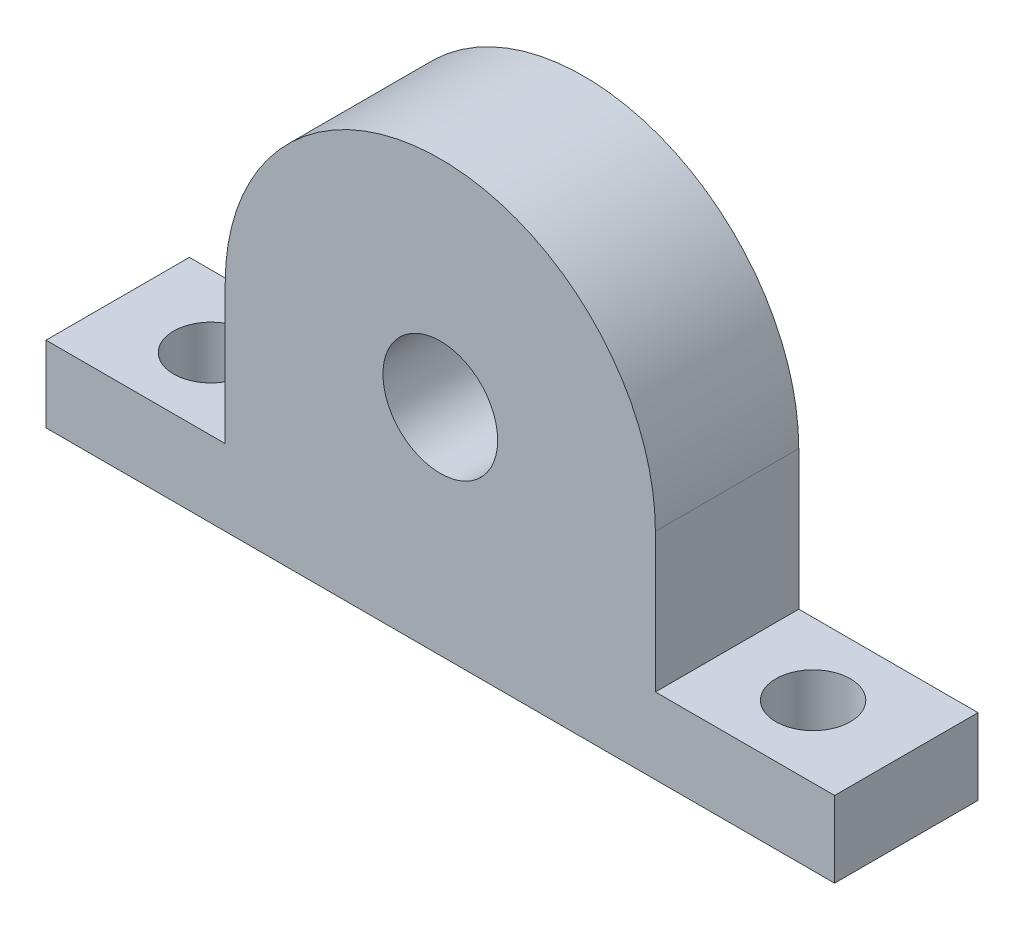
ISO-10303-21;
HEADER;
FILE_DESCRIPTION(('STEP AP214'),'2;1');
FILE_NAME('part.step','',(''),(''),'','','');
FILE_SCHEMA(('AUTOMOTIVE_DESIGN { 1 0 10303 214 1 1 1 1 }'));
ENDSEC;
DATA;
#1=APPLICATION_CONTEXT('core data for automotive mechanical design processes');
#2=APPLICATION_PROTOCOL_DEFINITION('international standard','automotive_design',2000,#1);
#3=PRODUCT_CONTEXT('',#1,'mechanical');
#4=PRODUCT('Part','Part','',(#3));
#5=PRODUCT_RELATED_PRODUCT_CATEGORY('part','',(#4));
#6=PRODUCT_DEFINITION_FORMATION('','',#4);
#7=PRODUCT_DEFINITION_CONTEXT('part definition',#1,'design');
#8=PRODUCT_DEFINITION('design','',#6,#7);
#9=PRODUCT_DEFINITION_SHAPE('','',#8);
#10=(LENGTH_UNIT() NAMED_UNIT(*) SI_UNIT(.MILLI.,.METRE.));
#11=(NAMED_UNIT(*) PLANE_ANGLE_UNIT() SI_UNIT($,.RADIAN.));
#12=(NAMED_UNIT(*) SI_UNIT($,.STERADIAN.) SOLID_ANGLE_UNIT());
#13=UNCERTAINTY_MEASURE_WITH_UNIT(LENGTH_MEASURE(1.E-05),#10,'distance_accuracy_value','');
#14=(GEOMETRIC_REPRESENTATION_CONTEXT(3) GLOBAL_UNCERTAINTY_ASSIGNED_CONTEXT((#13)) GLOBAL_UNIT_ASSIGNED_CONTEXT((#10,
#11,#12)) REPRESENTATION_CONTEXT('',''));
#15=CARTESIAN_POINT('',(0.,0.,0.));
#16=DIRECTION('',(0.,0.,1.));
#17=DIRECTION('',(1.,0.,0.));
#18=AXIS2_PLACEMENT_3D('',#15,#16,#17);
#19=CARTESIAN_POINT('',(0.,0.,10.));
#20=DIRECTION('',(0.,0.,1.));
#21=DIRECTION('',(1.,0.,0.));
#22=AXIS2_PLACEMENT_3D('',#19,#20,#21);
#23=PLANE('',#22);
#24=DIRECTION('',(0.,1.,0.));
#25=VECTOR('',#24,1.);
#26=CARTESIAN_POINT('',(27.5,-15.,10.));
#27=LINE('',#26,#25);
#28=CARTESIAN_POINT('',(27.5,-15.,10.));
#29=VERTEX_POINT('',#28);
#30=CARTESIAN_POINT('',(27.5,-9.7,10.));
#31=VERTEX_POINT('',#30);
#32=EDGE_CURVE('E169',#29,#31,#27,.T.);
#33=ORIENTED_EDGE('',*,*,#32,.T.);
#34=DIRECTION('',(-1.,0.,0.));
#35=VECTOR('',#34,1.);
#36=CARTESIAN_POINT('',(27.5,-9.7,10.));
#37=LINE('',#36,#35);
#38=CARTESIAN_POINT('',(15.,-9.7,10.));
#39=VERTEX_POINT('',#38);
#40=EDGE_CURVE('E105',#31,#39,#37,.T.);
#41=ORIENTED_EDGE('',*,*,#40,.T.);
#42=DIRECTION('',(0.,1.,0.));
#43=VECTOR('',#42,1.);
#44=CARTESIAN_POINT('',(15.,0.,10.));
#45=LINE('',#44,#43);
#46=CARTESIAN_POINT('',(15.,0.,10.));
#47=VERTEX_POINT('',#46);
#48=EDGE_CURVE('E215',#39,#47,#45,.T.);
#49=ORIENTED_EDGE('',*,*,#48,.T.);
#50=CARTESIAN_POINT('',(0.,0.,10.));
#51=DIRECTION('',(0.,0.,1.));
#52=DIRECTION('',(1.,0.,0.));
#53=AXIS2_PLACEMENT_3D('',#50,#51,#52);
#54=CIRCLE('',#53,15.);
#55=CARTESIAN_POINT('',(-15.0000000000001,0.,10.));
#56=VERTEX_POINT('',#55);
#57=EDGE_CURVE('E218',#47,#56,#54,.T.);
#58=ORIENTED_EDGE('',*,*,#57,.T.);
#59=DIRECTION('',(0.,-1.,0.));
#60=VECTOR('',#59,1.);
#61=CARTESIAN_POINT('',(-15.0000000000001,0.,10.));
#62=LINE('',#61,#60);
#63=CARTESIAN_POINT('',(-15.,-9.70000000000006,10.));
#64=VERTEX_POINT('',#63);
#65=EDGE_CURVE('E124',#56,#64,#62,.T.);
#66=ORIENTED_EDGE('',*,*,#65,.T.);
#67=DIRECTION('',(-1.,0.,0.));
#68=VECTOR('',#67,1.);
#69=CARTESIAN_POINT('',(-27.5,-9.7000000000001,10.));
#70=LINE('',#69,#68);
#71=CARTESIAN_POINT('',(-27.5,-9.7000000000001,10.));
#72=VERTEX_POINT('',#71);
#73=EDGE_CURVE('E118',#64,#72,#70,.T.);
#74=ORIENTED_EDGE('',*,*,#73,.T.);
#75=DIRECTION('',(0.,-1.,0.));
#76=VECTOR('',#75,1.);
#77=CARTESIAN_POINT('',(-27.5,-15.0000000000001,10.));
#78=LINE('',#77,#76);
#79=CARTESIAN_POINT('',(-27.5,-15.0000000000001,10.));
#80=VERTEX_POINT('',#79);
#81=EDGE_CURVE('E122',#72,#80,#78,.T.);
#82=ORIENTED_EDGE('',*,*,#81,.T.);
#83=DIRECTION('',(1.,0.,0.));
#84=VECTOR('',#83,1.);
#85=CARTESIAN_POINT('',(-27.5,-15.0000000000001,10.));
#86=LINE('',#85,#84);
#87=EDGE_CURVE('E62',#80,#29,#86,.T.);
#88=ORIENTED_EDGE('',*,*,#87,.T.);
#89=EDGE_LOOP('',(#33,#41,#49,#58,#66,#74,#82,#88));
#90=FACE_BOUND('',#89,.T.);
#91=CARTESIAN_POINT('',(0.,0.,10.));
#92=DIRECTION('',(0.,0.,1.));
#93=DIRECTION('',(1.,0.,0.));
#94=AXIS2_PLACEMENT_3D('',#91,#92,#93);
#95=CIRCLE('',#94,4.);
#96=CARTESIAN_POINT('',(4.,0.,10.));
#97=VERTEX_POINT('',#96);
#98=EDGE_CURVE('E151',#97,#97,#95,.T.);
#99=ORIENTED_EDGE('',*,*,#98,.F.);
#100=EDGE_LOOP('',(#99));
#101=FACE_BOUND('',#100,.T.);
#102=ADVANCED_FACE('F42',(#90,#101),#23,.T.);
#103=CARTESIAN_POINT('',(0.,0.,0.));
#104=DIRECTION('',(0.,0.,1.));
#105=DIRECTION('',(1.,0.,0.));
#106=AXIS2_PLACEMENT_3D('',#103,#104,#105);
#107=PLANE('',#106);
#108=DIRECTION('',(0.,1.,0.));
#109=VECTOR('',#108,1.);
#110=CARTESIAN_POINT('',(27.5,-15.,0.));
#111=LINE('',#110,#109);
#112=CARTESIAN_POINT('',(27.5,-15.,0.));
#113=VERTEX_POINT('',#112);
#114=CARTESIAN_POINT('',(27.5,-9.7,0.));
#115=VERTEX_POINT('',#114);
#116=EDGE_CURVE('E146',#113,#115,#111,.T.);
#117=ORIENTED_EDGE('',*,*,#116,.F.);
#118=DIRECTION('',(1.,0.,0.));
#119=VECTOR('',#118,1.);
#120=CARTESIAN_POINT('',(-27.5,-15.0000000000001,0.));
#121=LINE('',#120,#119);
#122=CARTESIAN_POINT('',(-27.5,-15.0000000000001,0.));
#123=VERTEX_POINT('',#122);
#124=EDGE_CURVE('E97',#123,#113,#121,.T.);
#125=ORIENTED_EDGE('',*,*,#124,.F.);
#126=DIRECTION('',(0.,-1.,0.));
#127=VECTOR('',#126,1.);
#128=CARTESIAN_POINT('',(-27.5,-15.0000000000001,0.));
#129=LINE('',#128,#127);
#130=CARTESIAN_POINT('',(-27.5,-9.7000000000001,0.));
#131=VERTEX_POINT('',#130);
#132=EDGE_CURVE('E91',#131,#123,#129,.T.);
#133=ORIENTED_EDGE('',*,*,#132,.F.);
#134=DIRECTION('',(-1.,0.,0.));
#135=VECTOR('',#134,1.);
#136=CARTESIAN_POINT('',(-27.5,-9.7000000000001,0.));
#137=LINE('',#136,#135);
#138=CARTESIAN_POINT('',(-15.,-9.70000000000006,0.));
#139=VERTEX_POINT('',#138);
#140=EDGE_CURVE('E133',#139,#131,#137,.T.);
#141=ORIENTED_EDGE('',*,*,#140,.F.);
#142=DIRECTION('',(0.,-1.,0.));
#143=VECTOR('',#142,1.);
#144=CARTESIAN_POINT('',(-15.0000000000001,0.,0.));
#145=LINE('',#144,#143);
#146=CARTESIAN_POINT('',(-15.0000000000001,0.,0.));
#147=VERTEX_POINT('',#146);
#148=EDGE_CURVE('E160',#147,#139,#145,.T.);
#149=ORIENTED_EDGE('',*,*,#148,.F.);
#150=CARTESIAN_POINT('',(0.,0.,0.));
#151=DIRECTION('',(0.,0.,1.));
#152=DIRECTION('',(1.,0.,0.));
#153=AXIS2_PLACEMENT_3D('',#150,#151,#152);
#154=CIRCLE('',#153,15.);
#155=CARTESIAN_POINT('',(15.,0.,0.));
#156=VERTEX_POINT('',#155);
#157=EDGE_CURVE('E157',#156,#147,#154,.T.);
#158=ORIENTED_EDGE('',*,*,#157,.F.);
#159=DIRECTION('',(0.,1.,0.));
#160=VECTOR('',#159,1.);
#161=CARTESIAN_POINT('',(15.,0.,0.));
#162=LINE('',#161,#160);
#163=CARTESIAN_POINT('',(15.,-9.7,0.));
#164=VERTEX_POINT('',#163);
#165=EDGE_CURVE('E154',#164,#156,#162,.T.);
#166=ORIENTED_EDGE('',*,*,#165,.F.);
#167=DIRECTION('',(-1.,0.,0.));
#168=VECTOR('',#167,1.);
#169=CARTESIAN_POINT('',(27.5,-9.7,0.));
#170=LINE('',#169,#168);
#171=EDGE_CURVE('E150',#115,#164,#170,.T.);
#172=ORIENTED_EDGE('',*,*,#171,.F.);
#173=EDGE_LOOP('',(#117,#125,#133,#141,#149,#158,#166,#172));
#174=FACE_BOUND('',#173,.T.);
#175=CARTESIAN_POINT('',(0.,0.,0.));
#176=DIRECTION('',(0.,0.,1.));
#177=DIRECTION('',(1.,0.,0.));
#178=AXIS2_PLACEMENT_3D('',#175,#176,#177);
#179=CIRCLE('',#178,4.);
#180=CARTESIAN_POINT('',(4.,0.,0.));
#181=VERTEX_POINT('',#180);
#182=EDGE_CURVE('E195',#181,#181,#179,.T.);
#183=ORIENTED_EDGE('',*,*,#182,.T.);
#184=EDGE_LOOP('',(#183));
#185=FACE_BOUND('',#184,.T.);
#186=ADVANCED_FACE('F233',(#174,#185),#107,.F.);
#187=CARTESIAN_POINT('',(27.5,-15.,10.));
#188=DIRECTION('',(-1.,0.,0.));
#189=DIRECTION('',(0.,0.,1.));
#190=AXIS2_PLACEMENT_3D('',#187,#188,#189);
#191=PLANE('',#190);
#192=ORIENTED_EDGE('',*,*,#116,.T.);
#193=DIRECTION('',(0.,0.,-1.));
#194=VECTOR('',#193,1.);
#195=CARTESIAN_POINT('',(27.5,-9.7,10.));
#196=LINE('',#195,#194);
#197=EDGE_CURVE('E11',#31,#115,#196,.T.);
#198=ORIENTED_EDGE('',*,*,#197,.F.);
#199=ORIENTED_EDGE('',*,*,#32,.F.);
#200=DIRECTION('',(0.,0.,-1.));
#201=VECTOR('',#200,1.);
#202=CARTESIAN_POINT('',(27.5,-15.,10.));
#203=LINE('',#202,#201);
#204=EDGE_CURVE('E142',#29,#113,#203,.T.);
#205=ORIENTED_EDGE('',*,*,#204,.T.);
#206=EDGE_LOOP('',(#192,#198,#199,#205));
#207=FACE_BOUND('',#206,.T.);
#208=ADVANCED_FACE('F44',(#207),#191,.F.);
#209=CARTESIAN_POINT('',(27.5,-9.7,10.));
#210=DIRECTION('',(0.,-1.,0.));
#211=DIRECTION('',(1.,0.,0.));
#212=AXIS2_PLACEMENT_3D('',#209,#210,#211);
#213=PLANE('',#212);
#214=CARTESIAN_POINT('',(21.,-9.7,5.));
#215=DIRECTION('',(0.,1.,0.));
#216=DIRECTION('',(-1.,0.,0.));
#217=AXIS2_PLACEMENT_3D('',#214,#215,#216);
#218=CIRCLE('',#217,2.6);
#219=CARTESIAN_POINT('',(18.4,-9.7,5.));
#220=VERTEX_POINT('',#219);
#221=EDGE_CURVE('E189',#220,#220,#218,.T.);
#222=ORIENTED_EDGE('',*,*,#221,.F.);
#223=EDGE_LOOP('',(#222));
#224=FACE_BOUND('',#223,.T.);
#225=ORIENTED_EDGE('',*,*,#171,.T.);
#226=DIRECTION('',(0.,0.,-1.));
#227=VECTOR('',#226,1.);
#228=CARTESIAN_POINT('',(15.,-9.7,10.));
#229=LINE('',#228,#227);
#230=EDGE_CURVE('E53',#39,#164,#229,.T.);
#231=ORIENTED_EDGE('',*,*,#230,.F.);
#232=ORIENTED_EDGE('',*,*,#40,.F.);
#233=ORIENTED_EDGE('',*,*,#197,.T.);
#234=EDGE_LOOP('',(#225,#231,#232,#233));
#235=FACE_BOUND('',#234,.T.);
#236=ADVANCED_FACE('F287',(#224,#235),#213,.F.);
#237=CARTESIAN_POINT('',(15.,0.,10.));
#238=DIRECTION('',(-1.,0.,0.));
#239=DIRECTION('',(0.,-1.,0.));
#240=AXIS2_PLACEMENT_3D('',#237,#238,#239);
#241=PLANE('',#240);
#242=ORIENTED_EDGE('',*,*,#165,.T.);
#243=DIRECTION('',(0.,0.,-1.));
#244=VECTOR('',#243,1.);
#245=CARTESIAN_POINT('',(15.,0.,10.));
#246=LINE('',#245,#244);
#247=EDGE_CURVE('E180',#47,#156,#246,.T.);
#248=ORIENTED_EDGE('',*,*,#247,.F.);
#249=ORIENTED_EDGE('',*,*,#48,.F.);
#250=ORIENTED_EDGE('',*,*,#230,.T.);
#251=EDGE_LOOP('',(#242,#248,#249,#250));
#252=FACE_BOUND('',#251,.T.);
#253=ADVANCED_FACE('F292',(#252),#241,.F.);
#254=CARTESIAN_POINT('',(0.,0.,10.));
#255=DIRECTION('',(0.,0.,-1.));
#256=DIRECTION('',(-1.,0.,0.));
#257=AXIS2_PLACEMENT_3D('',#254,#255,#256);
#258=CYLINDRICAL_SURFACE('',#257,15.);
#259=ORIENTED_EDGE('',*,*,#157,.T.);
#260=DIRECTION('',(0.,0.,-1.));
#261=VECTOR('',#260,1.);
#262=CARTESIAN_POINT('',(-15.0000000000001,0.,10.));
#263=LINE('',#262,#261);
#264=EDGE_CURVE('E176',#56,#147,#263,.T.);
#265=ORIENTED_EDGE('',*,*,#264,.F.);
#266=ORIENTED_EDGE('',*,*,#57,.F.);
#267=ORIENTED_EDGE('',*,*,#247,.T.);
#268=EDGE_LOOP('',(#259,#265,#266,#267));
#269=FACE_BOUND('',#268,.T.);
#270=ADVANCED_FACE('F226',(#269),#258,.T.);
#271=CARTESIAN_POINT('',(-15.0000000000001,0.,10.));
#272=DIRECTION('',(1.,0.,0.));
#273=DIRECTION('',(0.,1.,0.));
#274=AXIS2_PLACEMENT_3D('',#271,#272,#273);
#275=PLANE('',#274);
#276=ORIENTED_EDGE('',*,*,#148,.T.);
#277=DIRECTION('',(0.,0.,-1.));
#278=VECTOR('',#277,1.);
#279=CARTESIAN_POINT('',(-15.,-9.70000000000006,10.));
#280=LINE('',#279,#278);
#281=EDGE_CURVE('E135',#64,#139,#280,.T.);
#282=ORIENTED_EDGE('',*,*,#281,.F.);
#283=ORIENTED_EDGE('',*,*,#65,.F.);
#284=ORIENTED_EDGE('',*,*,#264,.T.);
#285=EDGE_LOOP('',(#276,#282,#283,#284));
#286=FACE_BOUND('',#285,.T.);
#287=ADVANCED_FACE('F230',(#286),#275,.F.);
#288=CARTESIAN_POINT('',(-27.5,-9.7000000000001,10.));
#289=DIRECTION('',(0.,-1.,0.));
#290=DIRECTION('',(1.,0.,0.));
#291=AXIS2_PLACEMENT_3D('',#288,#289,#290);
#292=PLANE('',#291);
#293=CARTESIAN_POINT('',(-21.,-9.70000000000001,4.99999999999994));
#294=DIRECTION('',(0.,1.,0.));
#295=DIRECTION('',(1.,0.,0.));
#296=AXIS2_PLACEMENT_3D('',#293,#294,#295);
#297=CIRCLE('',#296,2.6);
#298=CARTESIAN_POINT('',(-18.4,-9.70000000000001,4.99999999999994));
#299=VERTEX_POINT('',#298);
#300=EDGE_CURVE('E197',#299,#299,#297,.T.);
#301=ORIENTED_EDGE('',*,*,#300,.F.);
#302=EDGE_LOOP('',(#301));
#303=FACE_BOUND('',#302,.T.);
#304=ORIENTED_EDGE('',*,*,#140,.T.);
#305=DIRECTION('',(0.,0.,-1.));
#306=VECTOR('',#305,1.);
#307=CARTESIAN_POINT('',(-27.5,-9.7000000000001,10.));
#308=LINE('',#307,#306);
#309=EDGE_CURVE('E130',#72,#131,#308,.T.);
#310=ORIENTED_EDGE('',*,*,#309,.F.);
#311=ORIENTED_EDGE('',*,*,#73,.F.);
#312=ORIENTED_EDGE('',*,*,#281,.T.);
#313=EDGE_LOOP('',(#304,#310,#311,#312));
#314=FACE_BOUND('',#313,.T.);
#315=ADVANCED_FACE('F131',(#303,#314),#292,.F.);
#316=CARTESIAN_POINT('',(-27.5,-15.0000000000001,10.));
#317=DIRECTION('',(1.,0.,0.));
#318=DIRECTION('',(0.,1.,0.));
#319=AXIS2_PLACEMENT_3D('',#316,#317,#318);
#320=PLANE('',#319);
#321=ORIENTED_EDGE('',*,*,#132,.T.);
#322=DIRECTION('',(0.,0.,-1.));
#323=VECTOR('',#322,1.);
#324=CARTESIAN_POINT('',(-27.5,-15.0000000000001,10.));
#325=LINE('',#324,#323);
#326=EDGE_CURVE('E136',#80,#123,#325,.T.);
#327=ORIENTED_EDGE('',*,*,#326,.F.);
#328=ORIENTED_EDGE('',*,*,#81,.F.);
#329=ORIENTED_EDGE('',*,*,#309,.T.);
#330=EDGE_LOOP('',(#321,#327,#328,#329));
#331=FACE_BOUND('',#330,.T.);
#332=ADVANCED_FACE('F138',(#331),#320,.F.);
#333=CARTESIAN_POINT('',(-27.5,-15.0000000000001,10.));
#334=DIRECTION('',(0.,1.,0.));
#335=DIRECTION('',(-1.,0.,0.));
#336=AXIS2_PLACEMENT_3D('',#333,#334,#335);
#337=PLANE('',#336);
#338=CARTESIAN_POINT('',(21.,-15.,5.));
#339=DIRECTION('',(0.,1.,0.));
#340=DIRECTION('',(-1.,0.,0.));
#341=AXIS2_PLACEMENT_3D('',#338,#339,#340);
#342=CIRCLE('',#341,2.6);
#343=CARTESIAN_POINT('',(18.4,-15.,5.));
#344=VERTEX_POINT('',#343);
#345=EDGE_CURVE('E46',#344,#344,#342,.T.);
#346=ORIENTED_EDGE('',*,*,#345,.T.);
#347=EDGE_LOOP('',(#346));
#348=FACE_BOUND('',#347,.T.);
#349=CARTESIAN_POINT('',(-21.,-15.0000000000001,4.99999999999994));
#350=DIRECTION('',(0.,1.,0.));
#351=DIRECTION('',(-1.,0.,0.));
#352=AXIS2_PLACEMENT_3D('',#349,#350,#351);
#353=CIRCLE('',#352,2.6);
#354=CARTESIAN_POINT('',(-23.6,-15.0000000000001,4.99999999999994));
#355=VERTEX_POINT('',#354);
#356=EDGE_CURVE('E186',#355,#355,#353,.T.);
#357=ORIENTED_EDGE('',*,*,#356,.T.);
#358=EDGE_LOOP('',(#357));
#359=FACE_BOUND('',#358,.T.);
#360=ORIENTED_EDGE('',*,*,#124,.T.);
#361=ORIENTED_EDGE('',*,*,#204,.F.);
#362=ORIENTED_EDGE('',*,*,#87,.F.);
#363=ORIENTED_EDGE('',*,*,#326,.T.);
#364=EDGE_LOOP('',(#360,#361,#362,#363));
#365=FACE_BOUND('',#364,.T.);
#366=ADVANCED_FACE('F239',(#348,#359,#365),#337,.F.);
#367=CARTESIAN_POINT('',(0.,0.,10.));
#368=DIRECTION('',(0.,0.,-1.));
#369=DIRECTION('',(-1.,0.,0.));
#370=AXIS2_PLACEMENT_3D('',#367,#368,#369);
#371=CYLINDRICAL_SURFACE('',#370,4.);
#372=ORIENTED_EDGE('',*,*,#98,.T.);
#373=EDGE_LOOP('',(#372));
#374=FACE_BOUND('',#373,.T.);
#375=ORIENTED_EDGE('',*,*,#182,.F.);
#376=EDGE_LOOP('',(#375));
#377=FACE_BOUND('',#376,.T.);
#378=ADVANCED_FACE('F241',(#374,#377),#371,.F.);
#379=CARTESIAN_POINT('',(-21.,-19.7,4.99999999999994));
#380=DIRECTION('',(0.,1.,0.));
#381=DIRECTION('',(-1.,0.,0.));
#382=AXIS2_PLACEMENT_3D('',#379,#380,#381);
#383=CYLINDRICAL_SURFACE('',#382,2.6);
#384=ORIENTED_EDGE('',*,*,#300,.T.);
#385=EDGE_LOOP('',(#384));
#386=FACE_BOUND('',#385,.T.);
#387=ORIENTED_EDGE('',*,*,#356,.F.);
#388=EDGE_LOOP('',(#387));
#389=FACE_BOUND('',#388,.T.);
#390=ADVANCED_FACE('F248',(#386,#389),#383,.F.);
#391=CARTESIAN_POINT('',(21.,-19.7,5.));
#392=DIRECTION('',(0.,1.,0.));
#393=DIRECTION('',(-1.,0.,0.));
#394=AXIS2_PLACEMENT_3D('',#391,#392,#393);
#395=CYLINDRICAL_SURFACE('',#394,2.6);
#396=ORIENTED_EDGE('',*,*,#221,.T.);
#397=EDGE_LOOP('',(#396));
#398=FACE_BOUND('',#397,.T.);
#399=ORIENTED_EDGE('',*,*,#345,.F.);
#400=EDGE_LOOP('',(#399));
#401=FACE_BOUND('',#400,.T.);
#402=ADVANCED_FACE('F261',(#398,#401),#395,.F.);
#403=CLOSED_SHELL('',(#102,#186,#208,#236,#253,#270,#287,#315,#332,#366,#378,#390,#402));
#404=MANIFOLD_SOLID_BREP('B2',#403);
#405=ADVANCED_BREP_SHAPE_REPRESENTATION('',(#18,#404),#14);
#406=SHAPE_DEFINITION_REPRESENTATION(#9,#405);
ENDSEC;
END-ISO-10303-21;
